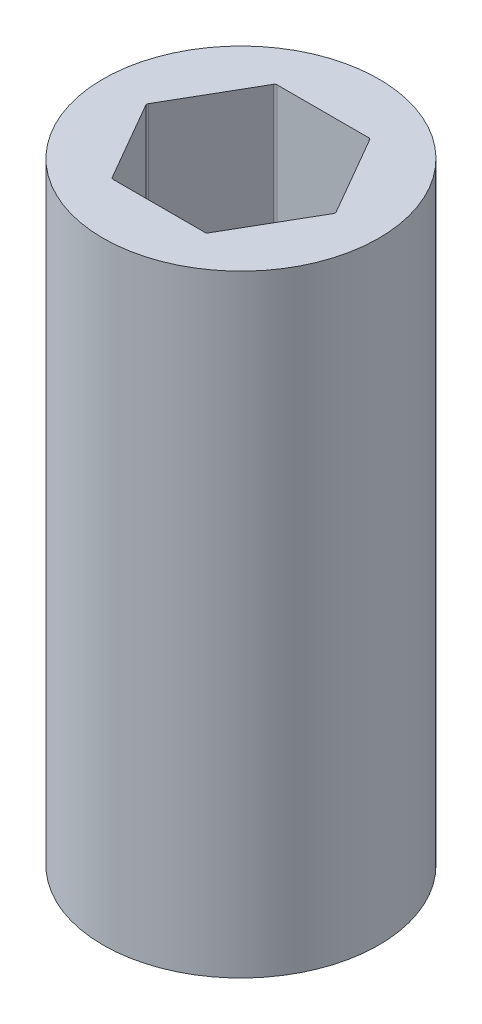
ISO-10303-21;
HEADER;
FILE_DESCRIPTION(('STEP AP214'),'2;1');
FILE_NAME('part.step','',(''),(''),'','','');
FILE_SCHEMA(('AUTOMOTIVE_DESIGN { 1 0 10303 214 1 1 1 1 }'));
ENDSEC;
DATA;
#1=APPLICATION_CONTEXT('core data for automotive mechanical design processes');
#2=APPLICATION_PROTOCOL_DEFINITION('international standard','automotive_design',2000,#1);
#3=PRODUCT_CONTEXT('',#1,'mechanical');
#4=PRODUCT('Part','Part','',(#3));
#5=PRODUCT_RELATED_PRODUCT_CATEGORY('part','',(#4));
#6=PRODUCT_DEFINITION_FORMATION('','',#4);
#7=PRODUCT_DEFINITION_CONTEXT('part definition',#1,'design');
#8=PRODUCT_DEFINITION('design','',#6,#7);
#9=PRODUCT_DEFINITION_SHAPE('','',#8);
#10=(LENGTH_UNIT() NAMED_UNIT(*) SI_UNIT(.MILLI.,.METRE.));
#11=(NAMED_UNIT(*) PLANE_ANGLE_UNIT() SI_UNIT($,.RADIAN.));
#12=(NAMED_UNIT(*) SI_UNIT($,.STERADIAN.) SOLID_ANGLE_UNIT());
#13=UNCERTAINTY_MEASURE_WITH_UNIT(LENGTH_MEASURE(1.E-05),#10,'distance_accuracy_value','');
#14=(GEOMETRIC_REPRESENTATION_CONTEXT(3) GLOBAL_UNCERTAINTY_ASSIGNED_CONTEXT((#13)) GLOBAL_UNIT_ASSIGNED_CONTEXT((#10,
#11,#12)) REPRESENTATION_CONTEXT('',''));
#15=CARTESIAN_POINT('',(0.,0.,0.));
#16=DIRECTION('',(0.,0.,1.));
#17=DIRECTION('',(1.,0.,0.));
#18=AXIS2_PLACEMENT_3D('',#15,#16,#17);
#19=CARTESIAN_POINT('',(0.,49.3268,0.));
#20=DIRECTION('',(0.,1.,0.));
#21=DIRECTION('',(0.,0.,1.));
#22=AXIS2_PLACEMENT_3D('',#19,#20,#21);
#23=PLANE('',#22);
#24=CARTESIAN_POINT('',(0.,49.3268,0.));
#25=DIRECTION('',(0.,1.,0.));
#26=DIRECTION('',(0.,0.,1.));
#27=AXIS2_PLACEMENT_3D('',#24,#25,#26);
#28=CIRCLE('',#27,11.1125);
#29=CARTESIAN_POINT('',(0.,49.3268,11.1125));
#30=VERTEX_POINT('',#29);
#31=EDGE_CURVE('E147',#30,#30,#28,.T.);
#32=ORIENTED_EDGE('',*,*,#31,.T.);
#33=EDGE_LOOP('',(#32));
#34=FACE_BOUND('',#33,.T.);
#35=DIRECTION('',(-0.5,0.,-0.866025403784438));
#36=VECTOR('',#35,1.);
#37=CARTESIAN_POINT('',(7.62564235545658,49.3268,0.));
#38=LINE('',#37,#36);
#39=CARTESIAN_POINT('',(7.56790732853761,49.3268,-0.100000000000002));
#40=VERTEX_POINT('',#39);
#41=CARTESIAN_POINT('',(3.87055620464725,49.3268,-6.504));
#42=VERTEX_POINT('',#41);
#43=EDGE_CURVE('E248',#40,#42,#38,.T.);
#44=ORIENTED_EDGE('',*,*,#43,.F.);
#45=CARTESIAN_POINT('',(7.39470224778073,49.3268,0.));
#46=DIRECTION('',(0.,1.,0.));
#47=DIRECTION('',(0.,0.,1.));
#48=AXIS2_PLACEMENT_3D('',#45,#46,#47);
#49=CIRCLE('',#48,0.2);
#50=CARTESIAN_POINT('',(7.56790732853762,49.3268,0.0999999999999968));
#51=VERTEX_POINT('',#50);
#52=EDGE_CURVE('E50',#40,#51,#49,.F.);
#53=ORIENTED_EDGE('',*,*,#52,.T.);
#54=DIRECTION('',(0.5,0.,-0.866025403784439));
#55=VECTOR('',#54,1.);
#56=CARTESIAN_POINT('',(3.81282117772829,49.3268,6.604));
#57=LINE('',#56,#55);
#58=CARTESIAN_POINT('',(3.87055620464725,49.3268,6.50400000000001));
#59=VERTEX_POINT('',#58);
#60=EDGE_CURVE('E206',#59,#51,#57,.T.);
#61=ORIENTED_EDGE('',*,*,#60,.F.);
#62=CARTESIAN_POINT('',(3.69735112389036,49.3268,6.40400000000001));
#63=DIRECTION('',(0.,1.,0.));
#64=DIRECTION('',(0.,0.,1.));
#65=AXIS2_PLACEMENT_3D('',#62,#63,#64);
#66=CIRCLE('',#65,0.2);
#67=CARTESIAN_POINT('',(3.69735112389036,49.3268,6.604));
#68=VERTEX_POINT('',#67);
#69=EDGE_CURVE('E135',#59,#68,#66,.F.);
#70=ORIENTED_EDGE('',*,*,#69,.T.);
#71=DIRECTION('',(1.,0.,0.));
#72=VECTOR('',#71,1.);
#73=CARTESIAN_POINT('',(-3.81282117772829,49.3268,6.604));
#74=LINE('',#73,#72);
#75=CARTESIAN_POINT('',(-3.69735112389036,49.3268,6.604));
#76=VERTEX_POINT('',#75);
#77=EDGE_CURVE('E213',#76,#68,#74,.T.);
#78=ORIENTED_EDGE('',*,*,#77,.F.);
#79=CARTESIAN_POINT('',(-3.69735112389036,49.3268,6.40400000000001));
#80=DIRECTION('',(0.,1.,0.));
#81=DIRECTION('',(0.,0.,1.));
#82=AXIS2_PLACEMENT_3D('',#79,#80,#81);
#83=CIRCLE('',#82,0.2);
#84=CARTESIAN_POINT('',(-3.87055620464725,49.3268,6.50400000000001));
#85=VERTEX_POINT('',#84);
#86=EDGE_CURVE('E11',#76,#85,#83,.F.);
#87=ORIENTED_EDGE('',*,*,#86,.T.);
#88=DIRECTION('',(0.5,0.,0.866025403784439));
#89=VECTOR('',#88,1.);
#90=CARTESIAN_POINT('',(-7.62564235545658,49.3268,0.));
#91=LINE('',#90,#89);
#92=CARTESIAN_POINT('',(-7.56790732853762,49.3268,0.1));
#93=VERTEX_POINT('',#92);
#94=EDGE_CURVE('E211',#93,#85,#91,.T.);
#95=ORIENTED_EDGE('',*,*,#94,.F.);
#96=CARTESIAN_POINT('',(-7.39470224778073,49.3268,0.));
#97=DIRECTION('',(0.,1.,0.));
#98=DIRECTION('',(0.,0.,1.));
#99=AXIS2_PLACEMENT_3D('',#96,#97,#98);
#100=CIRCLE('',#99,0.2);
#101=CARTESIAN_POINT('',(-7.56790732853762,49.3268,-0.0999999999999994));
#102=VERTEX_POINT('',#101);
#103=EDGE_CURVE('E188',#93,#102,#100,.F.);
#104=ORIENTED_EDGE('',*,*,#103,.T.);
#105=DIRECTION('',(-0.5,0.,0.866025403784439));
#106=VECTOR('',#105,1.);
#107=CARTESIAN_POINT('',(-3.81282117772829,49.3268,-6.604));
#108=LINE('',#107,#106);
#109=CARTESIAN_POINT('',(-3.87055620464725,49.3268,-6.504));
#110=VERTEX_POINT('',#109);
#111=EDGE_CURVE('E217',#110,#102,#108,.T.);
#112=ORIENTED_EDGE('',*,*,#111,.F.);
#113=CARTESIAN_POINT('',(-3.69735112389037,49.3268,-6.404));
#114=DIRECTION('',(0.,1.,0.));
#115=DIRECTION('',(0.,0.,1.));
#116=AXIS2_PLACEMENT_3D('',#113,#114,#115);
#117=CIRCLE('',#116,0.2);
#118=CARTESIAN_POINT('',(-3.69735112389037,49.3268,-6.604));
#119=VERTEX_POINT('',#118);
#120=EDGE_CURVE('E184',#110,#119,#117,.F.);
#121=ORIENTED_EDGE('',*,*,#120,.T.);
#122=DIRECTION('',(-1.,0.,0.));
#123=VECTOR('',#122,1.);
#124=CARTESIAN_POINT('',(3.81282117772829,49.3268,-6.604));
#125=LINE('',#124,#123);
#126=CARTESIAN_POINT('',(3.69735112389036,49.3268,-6.604));
#127=VERTEX_POINT('',#126);
#128=EDGE_CURVE('E221',#127,#119,#125,.T.);
#129=ORIENTED_EDGE('',*,*,#128,.F.);
#130=CARTESIAN_POINT('',(3.69735112389036,49.3268,-6.404));
#131=DIRECTION('',(0.,1.,0.));
#132=DIRECTION('',(0.,0.,1.));
#133=AXIS2_PLACEMENT_3D('',#130,#131,#132);
#134=CIRCLE('',#133,0.2);
#135=EDGE_CURVE('E180',#127,#42,#134,.F.);
#136=ORIENTED_EDGE('',*,*,#135,.T.);
#137=EDGE_LOOP('',(#44,#53,#61,#70,#78,#87,#95,#104,#112,#121,#129,#136));
#138=FACE_BOUND('',#137,.T.);
#139=ADVANCED_FACE('F35',(#34,#138),#23,.T.);
#140=CARTESIAN_POINT('',(0.,0.,0.));
#141=DIRECTION('',(0.,1.,0.));
#142=DIRECTION('',(0.,0.,1.));
#143=AXIS2_PLACEMENT_3D('',#140,#141,#142);
#144=PLANE('',#143);
#145=CARTESIAN_POINT('',(0.,0.,0.));
#146=DIRECTION('',(0.,1.,0.));
#147=DIRECTION('',(0.,0.,1.));
#148=AXIS2_PLACEMENT_3D('',#145,#146,#147);
#149=CIRCLE('',#148,11.1125);
#150=CARTESIAN_POINT('',(0.,0.,11.1125));
#151=VERTEX_POINT('',#150);
#152=EDGE_CURVE('E152',#151,#151,#149,.T.);
#153=ORIENTED_EDGE('',*,*,#152,.F.);
#154=EDGE_LOOP('',(#153));
#155=FACE_BOUND('',#154,.T.);
#156=DIRECTION('',(1.,0.,0.));
#157=VECTOR('',#156,1.);
#158=CARTESIAN_POINT('',(-3.81282117772829,0.,6.604));
#159=LINE('',#158,#157);
#160=CARTESIAN_POINT('',(-3.69735112389036,0.,6.604));
#161=VERTEX_POINT('',#160);
#162=CARTESIAN_POINT('',(3.69735112389036,0.,6.604));
#163=VERTEX_POINT('',#162);
#164=EDGE_CURVE('E195',#161,#163,#159,.T.);
#165=ORIENTED_EDGE('',*,*,#164,.T.);
#166=CARTESIAN_POINT('',(3.69735112389036,0.,6.40400000000001));
#167=DIRECTION('',(0.,1.,0.));
#168=DIRECTION('',(0.,0.,1.));
#169=AXIS2_PLACEMENT_3D('',#166,#167,#168);
#170=CIRCLE('',#169,0.2);
#171=CARTESIAN_POINT('',(3.87055620464725,0.,6.50400000000001));
#172=VERTEX_POINT('',#171);
#173=EDGE_CURVE('E190',#163,#172,#170,.T.);
#174=ORIENTED_EDGE('',*,*,#173,.T.);
#175=DIRECTION('',(0.5,0.,-0.866025403784439));
#176=VECTOR('',#175,1.);
#177=CARTESIAN_POINT('',(3.81282117772829,0.,6.604));
#178=LINE('',#177,#176);
#179=CARTESIAN_POINT('',(7.56790732853762,0.,0.0999999999999968));
#180=VERTEX_POINT('',#179);
#181=EDGE_CURVE('E130',#172,#180,#178,.T.);
#182=ORIENTED_EDGE('',*,*,#181,.T.);
#183=CARTESIAN_POINT('',(7.39470224778073,0.,0.));
#184=DIRECTION('',(0.,1.,0.));
#185=DIRECTION('',(0.,0.,1.));
#186=AXIS2_PLACEMENT_3D('',#183,#184,#185);
#187=CIRCLE('',#186,0.2);
#188=CARTESIAN_POINT('',(7.56790732853761,0.,-0.100000000000002));
#189=VERTEX_POINT('',#188);
#190=EDGE_CURVE('E125',#180,#189,#187,.T.);
#191=ORIENTED_EDGE('',*,*,#190,.T.);
#192=DIRECTION('',(-0.5,0.,-0.866025403784438));
#193=VECTOR('',#192,1.);
#194=CARTESIAN_POINT('',(7.62564235545658,0.,0.));
#195=LINE('',#194,#193);
#196=CARTESIAN_POINT('',(3.87055620464725,0.,-6.504));
#197=VERTEX_POINT('',#196);
#198=EDGE_CURVE('E129',#189,#197,#195,.T.);
#199=ORIENTED_EDGE('',*,*,#198,.T.);
#200=CARTESIAN_POINT('',(3.69735112389036,0.,-6.404));
#201=DIRECTION('',(0.,1.,0.));
#202=DIRECTION('',(0.,0.,1.));
#203=AXIS2_PLACEMENT_3D('',#200,#201,#202);
#204=CIRCLE('',#203,0.2);
#205=CARTESIAN_POINT('',(3.69735112389036,0.,-6.604));
#206=VERTEX_POINT('',#205);
#207=EDGE_CURVE('E178',#197,#206,#204,.T.);
#208=ORIENTED_EDGE('',*,*,#207,.T.);
#209=DIRECTION('',(-1.,0.,0.));
#210=VECTOR('',#209,1.);
#211=CARTESIAN_POINT('',(3.81282117772829,0.,-6.604));
#212=LINE('',#211,#210);
#213=CARTESIAN_POINT('',(-3.69735112389037,0.,-6.604));
#214=VERTEX_POINT('',#213);
#215=EDGE_CURVE('E144',#206,#214,#212,.T.);
#216=ORIENTED_EDGE('',*,*,#215,.T.);
#217=CARTESIAN_POINT('',(-3.69735112389037,0.,-6.404));
#218=DIRECTION('',(0.,1.,0.));
#219=DIRECTION('',(0.,0.,1.));
#220=AXIS2_PLACEMENT_3D('',#217,#218,#219);
#221=CIRCLE('',#220,0.2);
#222=CARTESIAN_POINT('',(-3.87055620464725,0.,-6.504));
#223=VERTEX_POINT('',#222);
#224=EDGE_CURVE('E182',#214,#223,#221,.T.);
#225=ORIENTED_EDGE('',*,*,#224,.T.);
#226=DIRECTION('',(-0.5,0.,0.866025403784439));
#227=VECTOR('',#226,1.);
#228=CARTESIAN_POINT('',(-3.81282117772829,0.,-6.604));
#229=LINE('',#228,#227);
#230=CARTESIAN_POINT('',(-7.56790732853762,0.,-0.0999999999999994));
#231=VERTEX_POINT('',#230);
#232=EDGE_CURVE('E228',#223,#231,#229,.T.);
#233=ORIENTED_EDGE('',*,*,#232,.T.);
#234=CARTESIAN_POINT('',(-7.39470224778073,0.,0.));
#235=DIRECTION('',(0.,1.,0.));
#236=DIRECTION('',(0.,0.,1.));
#237=AXIS2_PLACEMENT_3D('',#234,#235,#236);
#238=CIRCLE('',#237,0.2);
#239=CARTESIAN_POINT('',(-7.56790732853762,0.,0.1));
#240=VERTEX_POINT('',#239);
#241=EDGE_CURVE('E186',#231,#240,#238,.T.);
#242=ORIENTED_EDGE('',*,*,#241,.T.);
#243=DIRECTION('',(0.5,0.,0.866025403784439));
#244=VECTOR('',#243,1.);
#245=CARTESIAN_POINT('',(-7.62564235545658,0.,0.));
#246=LINE('',#245,#244);
#247=CARTESIAN_POINT('',(-3.87055620464725,0.,6.50400000000001));
#248=VERTEX_POINT('',#247);
#249=EDGE_CURVE('E197',#240,#248,#246,.T.);
#250=ORIENTED_EDGE('',*,*,#249,.T.);
#251=CARTESIAN_POINT('',(-3.69735112389036,0.,6.40400000000001));
#252=DIRECTION('',(0.,1.,0.));
#253=DIRECTION('',(0.,0.,1.));
#254=AXIS2_PLACEMENT_3D('',#251,#252,#253);
#255=CIRCLE('',#254,0.2);
#256=EDGE_CURVE('E43',#248,#161,#255,.T.);
#257=ORIENTED_EDGE('',*,*,#256,.T.);
#258=EDGE_LOOP('',(#165,#174,#182,#191,#199,#208,#216,#225,#233,#242,#250,#257));
#259=FACE_BOUND('',#258,.T.);
#260=ADVANCED_FACE('F128',(#155,#259),#144,.F.);
#261=CARTESIAN_POINT('',(0.,49.3268,0.));
#262=DIRECTION('',(0.,-1.,0.));
#263=DIRECTION('',(0.,0.,-1.));
#264=AXIS2_PLACEMENT_3D('',#261,#262,#263);
#265=CYLINDRICAL_SURFACE('',#264,11.1125);
#266=ORIENTED_EDGE('',*,*,#31,.F.);
#267=EDGE_LOOP('',(#266));
#268=FACE_BOUND('',#267,.T.);
#269=ORIENTED_EDGE('',*,*,#152,.T.);
#270=EDGE_LOOP('',(#269));
#271=FACE_BOUND('',#270,.T.);
#272=ADVANCED_FACE('F270',(#268,#271),#265,.T.);
#273=CARTESIAN_POINT('',(3.81282117772829,49.3268,6.604));
#274=DIRECTION('',(-0.866025403784439,0.,-0.5));
#275=DIRECTION('',(-0.5,0.,0.866025403784439));
#276=AXIS2_PLACEMENT_3D('',#273,#274,#275);
#277=PLANE('',#276);
#278=ORIENTED_EDGE('',*,*,#181,.F.);
#279=DIRECTION('',(0.,-1.,0.));
#280=VECTOR('',#279,1.);
#281=CARTESIAN_POINT('',(3.87055620464725,49.3268,6.50400000000001));
#282=LINE('',#281,#280);
#283=EDGE_CURVE('E57',#172,#59,#282,.F.);
#284=ORIENTED_EDGE('',*,*,#283,.T.);
#285=ORIENTED_EDGE('',*,*,#60,.T.);
#286=DIRECTION('',(0.,-1.,0.));
#287=VECTOR('',#286,1.);
#288=CARTESIAN_POINT('',(7.56790732853762,0.,0.0999999999999974));
#289=LINE('',#288,#287);
#290=EDGE_CURVE('E175',#51,#180,#289,.T.);
#291=ORIENTED_EDGE('',*,*,#290,.T.);
#292=EDGE_LOOP('',(#278,#284,#285,#291));
#293=FACE_BOUND('',#292,.T.);
#294=ADVANCED_FACE('F251',(#293),#277,.T.);
#295=CARTESIAN_POINT('',(7.62564235545658,49.3268,0.));
#296=DIRECTION('',(-0.866025403784439,0.,0.5));
#297=DIRECTION('',(0.5,0.,0.866025403784439));
#298=AXIS2_PLACEMENT_3D('',#295,#296,#297);
#299=PLANE('',#298);
#300=ORIENTED_EDGE('',*,*,#43,.T.);
#301=DIRECTION('',(0.,-1.,0.));
#302=VECTOR('',#301,1.);
#303=CARTESIAN_POINT('',(3.87055620464725,0.,-6.504));
#304=LINE('',#303,#302);
#305=EDGE_CURVE('E143',#42,#197,#304,.T.);
#306=ORIENTED_EDGE('',*,*,#305,.T.);
#307=ORIENTED_EDGE('',*,*,#198,.F.);
#308=DIRECTION('',(0.,-1.,0.));
#309=VECTOR('',#308,1.);
#310=CARTESIAN_POINT('',(7.56790732853761,49.3268,-0.100000000000002));
#311=LINE('',#310,#309);
#312=EDGE_CURVE('E141',#189,#40,#311,.F.);
#313=ORIENTED_EDGE('',*,*,#312,.T.);
#314=EDGE_LOOP('',(#300,#306,#307,#313));
#315=FACE_BOUND('',#314,.T.);
#316=ADVANCED_FACE('F140',(#315),#299,.T.);
#317=CARTESIAN_POINT('',(3.81282117772829,49.3268,-6.604));
#318=DIRECTION('',(0.,0.,1.));
#319=DIRECTION('',(1.,0.,0.));
#320=AXIS2_PLACEMENT_3D('',#317,#318,#319);
#321=PLANE('',#320);
#322=ORIENTED_EDGE('',*,*,#215,.F.);
#323=DIRECTION('',(0.,-1.,0.));
#324=VECTOR('',#323,1.);
#325=CARTESIAN_POINT('',(3.69735112389036,49.3268,-6.604));
#326=LINE('',#325,#324);
#327=EDGE_CURVE('E158',#206,#127,#326,.F.);
#328=ORIENTED_EDGE('',*,*,#327,.T.);
#329=ORIENTED_EDGE('',*,*,#128,.T.);
#330=DIRECTION('',(0.,-1.,0.));
#331=VECTOR('',#330,1.);
#332=CARTESIAN_POINT('',(-3.69735112389037,0.,-6.604));
#333=LINE('',#332,#331);
#334=EDGE_CURVE('E149',#119,#214,#333,.T.);
#335=ORIENTED_EDGE('',*,*,#334,.T.);
#336=EDGE_LOOP('',(#322,#328,#329,#335));
#337=FACE_BOUND('',#336,.T.);
#338=ADVANCED_FACE('F246',(#337),#321,.T.);
#339=CARTESIAN_POINT('',(-3.81282117772829,49.3268,-6.604));
#340=DIRECTION('',(0.866025403784439,0.,0.5));
#341=DIRECTION('',(0.5,0.,-0.866025403784439));
#342=AXIS2_PLACEMENT_3D('',#339,#340,#341);
#343=PLANE('',#342);
#344=ORIENTED_EDGE('',*,*,#232,.F.);
#345=DIRECTION('',(0.,-1.,0.));
#346=VECTOR('',#345,1.);
#347=CARTESIAN_POINT('',(-3.87055620464725,49.3268,-6.504));
#348=LINE('',#347,#346);
#349=EDGE_CURVE('E163',#223,#110,#348,.F.);
#350=ORIENTED_EDGE('',*,*,#349,.T.);
#351=ORIENTED_EDGE('',*,*,#111,.T.);
#352=DIRECTION('',(0.,-1.,0.));
#353=VECTOR('',#352,1.);
#354=CARTESIAN_POINT('',(-7.56790732853762,0.,-0.0999999999999991));
#355=LINE('',#354,#353);
#356=EDGE_CURVE('E160',#102,#231,#355,.T.);
#357=ORIENTED_EDGE('',*,*,#356,.T.);
#358=EDGE_LOOP('',(#344,#350,#351,#357));
#359=FACE_BOUND('',#358,.T.);
#360=ADVANCED_FACE('F234',(#359),#343,.T.);
#361=CARTESIAN_POINT('',(-7.62564235545658,49.3268,0.));
#362=DIRECTION('',(0.866025403784439,0.,-0.5));
#363=DIRECTION('',(-0.5,0.,-0.866025403784439));
#364=AXIS2_PLACEMENT_3D('',#361,#362,#363);
#365=PLANE('',#364);
#366=ORIENTED_EDGE('',*,*,#249,.F.);
#367=DIRECTION('',(0.,-1.,0.));
#368=VECTOR('',#367,1.);
#369=CARTESIAN_POINT('',(-7.56790732853762,49.3268,0.1));
#370=LINE('',#369,#368);
#371=EDGE_CURVE('E168',#240,#93,#370,.F.);
#372=ORIENTED_EDGE('',*,*,#371,.T.);
#373=ORIENTED_EDGE('',*,*,#94,.T.);
#374=DIRECTION('',(0.,-1.,0.));
#375=VECTOR('',#374,1.);
#376=CARTESIAN_POINT('',(-3.87055620464725,0.,6.504));
#377=LINE('',#376,#375);
#378=EDGE_CURVE('E165',#85,#248,#377,.T.);
#379=ORIENTED_EDGE('',*,*,#378,.T.);
#380=EDGE_LOOP('',(#366,#372,#373,#379));
#381=FACE_BOUND('',#380,.T.);
#382=ADVANCED_FACE('F215',(#381),#365,.T.);
#383=CARTESIAN_POINT('',(-3.81282117772829,49.3268,6.604));
#384=DIRECTION('',(0.,0.,-1.));
#385=DIRECTION('',(-1.,0.,0.));
#386=AXIS2_PLACEMENT_3D('',#383,#384,#385);
#387=PLANE('',#386);
#388=ORIENTED_EDGE('',*,*,#77,.T.);
#389=DIRECTION('',(0.,-1.,0.));
#390=VECTOR('',#389,1.);
#391=CARTESIAN_POINT('',(3.69735112389036,0.,6.604));
#392=LINE('',#391,#390);
#393=EDGE_CURVE('E172',#68,#163,#392,.T.);
#394=ORIENTED_EDGE('',*,*,#393,.T.);
#395=ORIENTED_EDGE('',*,*,#164,.F.);
#396=DIRECTION('',(0.,-1.,0.));
#397=VECTOR('',#396,1.);
#398=CARTESIAN_POINT('',(-3.69735112389036,49.3268,6.604));
#399=LINE('',#398,#397);
#400=EDGE_CURVE('E170',#161,#76,#399,.F.);
#401=ORIENTED_EDGE('',*,*,#400,.T.);
#402=EDGE_LOOP('',(#388,#394,#395,#401));
#403=FACE_BOUND('',#402,.T.);
#404=ADVANCED_FACE('F203',(#403),#387,.T.);
#405=CARTESIAN_POINT('',(3.69735112389036,49.3268,-6.404));
#406=DIRECTION('',(0.,1.,0.));
#407=DIRECTION('',(0.,0.,1.));
#408=AXIS2_PLACEMENT_3D('',#405,#406,#407);
#409=CYLINDRICAL_SURFACE('',#408,0.2);
#410=ORIENTED_EDGE('',*,*,#135,.F.);
#411=ORIENTED_EDGE('',*,*,#327,.F.);
#412=ORIENTED_EDGE('',*,*,#207,.F.);
#413=ORIENTED_EDGE('',*,*,#305,.F.);
#414=EDGE_LOOP('',(#410,#411,#412,#413));
#415=FACE_BOUND('',#414,.T.);
#416=ADVANCED_FACE('F279',(#415),#409,.F.);
#417=CARTESIAN_POINT('',(-3.69735112389037,49.3268,-6.404));
#418=DIRECTION('',(0.,1.,0.));
#419=DIRECTION('',(0.,0.,1.));
#420=AXIS2_PLACEMENT_3D('',#417,#418,#419);
#421=CYLINDRICAL_SURFACE('',#420,0.2);
#422=ORIENTED_EDGE('',*,*,#120,.F.);
#423=ORIENTED_EDGE('',*,*,#349,.F.);
#424=ORIENTED_EDGE('',*,*,#224,.F.);
#425=ORIENTED_EDGE('',*,*,#334,.F.);
#426=EDGE_LOOP('',(#422,#423,#424,#425));
#427=FACE_BOUND('',#426,.T.);
#428=ADVANCED_FACE('F239',(#427),#421,.F.);
#429=CARTESIAN_POINT('',(-7.39470224778073,49.3268,0.));
#430=DIRECTION('',(0.,1.,0.));
#431=DIRECTION('',(0.,0.,1.));
#432=AXIS2_PLACEMENT_3D('',#429,#430,#431);
#433=CYLINDRICAL_SURFACE('',#432,0.2);
#434=ORIENTED_EDGE('',*,*,#103,.F.);
#435=ORIENTED_EDGE('',*,*,#371,.F.);
#436=ORIENTED_EDGE('',*,*,#241,.F.);
#437=ORIENTED_EDGE('',*,*,#356,.F.);
#438=EDGE_LOOP('',(#434,#435,#436,#437));
#439=FACE_BOUND('',#438,.T.);
#440=ADVANCED_FACE('F256',(#439),#433,.F.);
#441=CARTESIAN_POINT('',(3.69735112389036,49.3268,6.40400000000001));
#442=DIRECTION('',(0.,1.,0.));
#443=DIRECTION('',(0.,0.,1.));
#444=AXIS2_PLACEMENT_3D('',#441,#442,#443);
#445=CYLINDRICAL_SURFACE('',#444,0.2);
#446=ORIENTED_EDGE('',*,*,#69,.F.);
#447=ORIENTED_EDGE('',*,*,#283,.F.);
#448=ORIENTED_EDGE('',*,*,#173,.F.);
#449=ORIENTED_EDGE('',*,*,#393,.F.);
#450=EDGE_LOOP('',(#446,#447,#448,#449));
#451=FACE_BOUND('',#450,.T.);
#452=ADVANCED_FACE('F254',(#451),#445,.F.);
#453=CARTESIAN_POINT('',(7.39470224778073,49.3268,0.));
#454=DIRECTION('',(0.,1.,0.));
#455=DIRECTION('',(0.,0.,1.));
#456=AXIS2_PLACEMENT_3D('',#453,#454,#455);
#457=CYLINDRICAL_SURFACE('',#456,0.2);
#458=ORIENTED_EDGE('',*,*,#52,.F.);
#459=ORIENTED_EDGE('',*,*,#312,.F.);
#460=ORIENTED_EDGE('',*,*,#190,.F.);
#461=ORIENTED_EDGE('',*,*,#290,.F.);
#462=EDGE_LOOP('',(#458,#459,#460,#461));
#463=FACE_BOUND('',#462,.T.);
#464=ADVANCED_FACE('F146',(#463),#457,.F.);
#465=CARTESIAN_POINT('',(-3.69735112389036,49.3268,6.40400000000001));
#466=DIRECTION('',(0.,1.,0.));
#467=DIRECTION('',(0.,0.,1.));
#468=AXIS2_PLACEMENT_3D('',#465,#466,#467);
#469=CYLINDRICAL_SURFACE('',#468,0.2);
#470=ORIENTED_EDGE('',*,*,#86,.F.);
#471=ORIENTED_EDGE('',*,*,#400,.F.);
#472=ORIENTED_EDGE('',*,*,#256,.F.);
#473=ORIENTED_EDGE('',*,*,#378,.F.);
#474=EDGE_LOOP('',(#470,#471,#472,#473));
#475=FACE_BOUND('',#474,.T.);
#476=ADVANCED_FACE('F37',(#475),#469,.F.);
#477=CLOSED_SHELL('',(#139,#260,#272,#294,#316,#338,#360,#382,#404,#416,#428,#440,#452,#464,#476));
#478=MANIFOLD_SOLID_BREP('B2',#477);
#479=ADVANCED_BREP_SHAPE_REPRESENTATION('',(#18,#478),#14);
#480=SHAPE_DEFINITION_REPRESENTATION(#9,#479);
ENDSEC;
END-ISO-10303-21;
